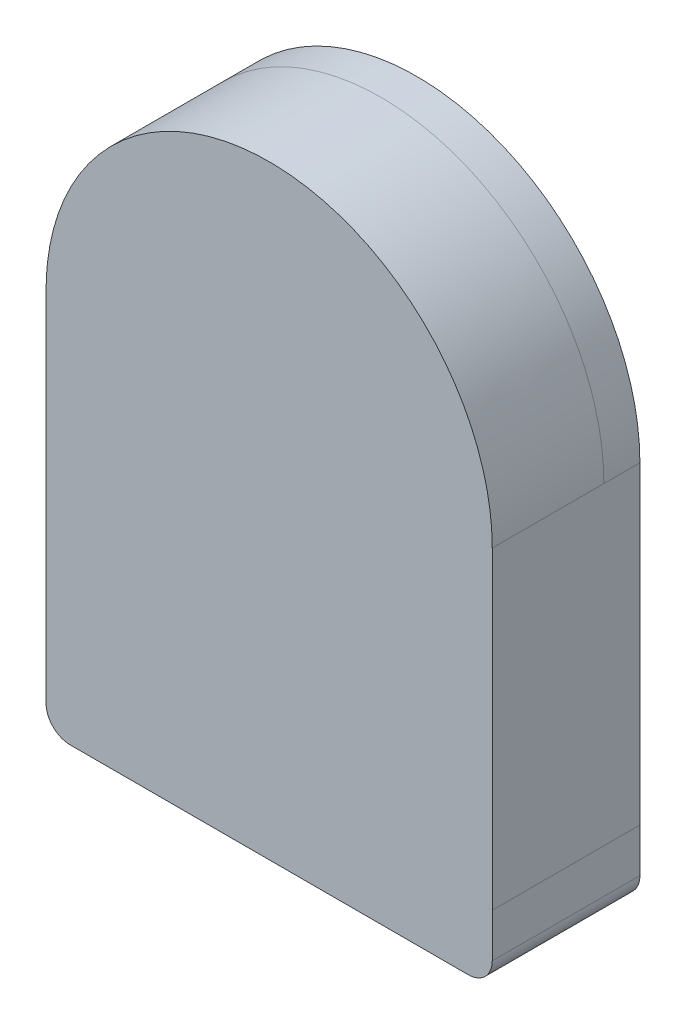
ISO-10303-21;
HEADER;
FILE_DESCRIPTION(('STEP AP214'),'2;1');
FILE_NAME('part.step','',(''),(''),'','','');
FILE_SCHEMA(('AUTOMOTIVE_DESIGN { 1 0 10303 214 1 1 1 1 }'));
ENDSEC;
DATA;
#1=APPLICATION_CONTEXT('core data for automotive mechanical design processes');
#2=APPLICATION_PROTOCOL_DEFINITION('international standard','automotive_design',2000,#1);
#3=PRODUCT_CONTEXT('',#1,'mechanical');
#4=PRODUCT('Part','Part','',(#3));
#5=PRODUCT_RELATED_PRODUCT_CATEGORY('part','',(#4));
#6=PRODUCT_DEFINITION_FORMATION('','',#4);
#7=PRODUCT_DEFINITION_CONTEXT('part definition',#1,'design');
#8=PRODUCT_DEFINITION('design','',#6,#7);
#9=PRODUCT_DEFINITION_SHAPE('','',#8);
#10=(LENGTH_UNIT() NAMED_UNIT(*) SI_UNIT(.MILLI.,.METRE.));
#11=(NAMED_UNIT(*) PLANE_ANGLE_UNIT() SI_UNIT($,.RADIAN.));
#12=(NAMED_UNIT(*) SI_UNIT($,.STERADIAN.) SOLID_ANGLE_UNIT());
#13=UNCERTAINTY_MEASURE_WITH_UNIT(LENGTH_MEASURE(1.E-05),#10,'distance_accuracy_value','');
#14=(GEOMETRIC_REPRESENTATION_CONTEXT(3) GLOBAL_UNCERTAINTY_ASSIGNED_CONTEXT((#13)) GLOBAL_UNIT_ASSIGNED_CONTEXT((#10,
#11,#12)) REPRESENTATION_CONTEXT('',''));
#15=CARTESIAN_POINT('',(0.,0.,0.));
#16=DIRECTION('',(0.,0.,1.));
#17=DIRECTION('',(1.,0.,0.));
#18=AXIS2_PLACEMENT_3D('',#15,#16,#17);
#19=CARTESIAN_POINT('',(8.29127246754,-14.8912724675,3.075));
#20=DIRECTION('',(0.,0.,-1.));
#21=DIRECTION('',(1.,0.,0.));
#22=AXIS2_PLACEMENT_3D('',#19,#20,#21);
#23=CYLINDRICAL_SURFACE('',#22,1.);
#24=CARTESIAN_POINT('',(8.29127246754,-14.8912724675,0.));
#25=DIRECTION('',(0.,0.,1.));
#26=DIRECTION('',(1.,0.,0.));
#27=AXIS2_PLACEMENT_3D('',#24,#25,#26);
#28=CIRCLE('',#27,1.);
#29=CARTESIAN_POINT('',(8.29127246754,-15.8912724675,0.));
#30=VERTEX_POINT('',#29);
#31=CARTESIAN_POINT('',(9.29127246754,-14.8912724675,0.));
#32=VERTEX_POINT('',#31);
#33=EDGE_CURVE('E11',#30,#32,#28,.T.);
#34=ORIENTED_EDGE('',*,*,#33,.T.);
#35=DIRECTION('',(0.,0.,-1.));
#36=VECTOR('',#35,1.);
#37=CARTESIAN_POINT('',(9.29127246754,-14.8912724675,3.075));
#38=LINE('',#37,#36);
#39=CARTESIAN_POINT('',(9.29127246754,-14.8912724675,6.15));
#40=VERTEX_POINT('',#39);
#41=EDGE_CURVE('E207',#40,#32,#38,.T.);
#42=ORIENTED_EDGE('',*,*,#41,.F.);
#43=CARTESIAN_POINT('',(8.29127246754,-14.8912724675,6.15));
#44=DIRECTION('',(0.,0.,-1.));
#45=DIRECTION('',(1.,0.,0.));
#46=AXIS2_PLACEMENT_3D('',#43,#44,#45);
#47=CIRCLE('',#46,1.);
#48=CARTESIAN_POINT('',(8.29127246754,-15.8912724675,6.15));
#49=VERTEX_POINT('',#48);
#50=EDGE_CURVE('E26',#40,#49,#47,.T.);
#51=ORIENTED_EDGE('',*,*,#50,.T.);
#52=DIRECTION('',(0.,0.,-1.));
#53=VECTOR('',#52,1.);
#54=CARTESIAN_POINT('',(8.29127246754,-15.8912724675,3.075));
#55=LINE('',#54,#53);
#56=EDGE_CURVE('E214',#49,#30,#55,.T.);
#57=ORIENTED_EDGE('',*,*,#56,.T.);
#58=EDGE_LOOP('',(#34,#42,#51,#57));
#59=FACE_BOUND('',#58,.T.);
#60=ADVANCED_FACE('F16',(#59),#23,.T.);
#61=CARTESIAN_POINT('',(0.,-3.3,0.));
#62=DIRECTION('',(0.,0.,1.));
#63=DIRECTION('',(1.,0.,0.));
#64=AXIS2_PLACEMENT_3D('',#61,#62,#63);
#65=PLANE('',#64);
#66=ORIENTED_EDGE('',*,*,#33,.F.);
#67=DIRECTION('',(1.,0.,0.));
#68=VECTOR('',#67,1.);
#69=CARTESIAN_POINT('',(6.67750706079,-15.8912724675,0.));
#70=LINE('',#69,#68);
#71=CARTESIAN_POINT('',(5.06374165404,-15.8912724675,0.));
#72=VERTEX_POINT('',#71);
#73=EDGE_CURVE('E203',#72,#30,#70,.T.);
#74=ORIENTED_EDGE('',*,*,#73,.F.);
#75=DIRECTION('',(1.,0.,0.));
#76=VECTOR('',#75,1.);
#77=CARTESIAN_POINT('',(0.00328049456473,-15.8912724675,0.));
#78=LINE('',#77,#76);
#79=CARTESIAN_POINT('',(-5.05718066429,-15.8912724675,0.));
#80=VERTEX_POINT('',#79);
#81=EDGE_CURVE('E161',#80,#72,#78,.T.);
#82=ORIENTED_EDGE('',*,*,#81,.F.);
#83=DIRECTION('',(1.,0.,0.));
#84=VECTOR('',#83,1.);
#85=CARTESIAN_POINT('',(-6.67422656592,-15.8912724675,0.));
#86=LINE('',#85,#84);
#87=CARTESIAN_POINT('',(-8.29127246754,-15.8912724675,0.));
#88=VERTEX_POINT('',#87);
#89=EDGE_CURVE('E156',#88,#80,#86,.T.);
#90=ORIENTED_EDGE('',*,*,#89,.F.);
#91=CARTESIAN_POINT('',(-8.29127246754,-14.8912724675,0.));
#92=DIRECTION('',(0.,0.,1.));
#93=DIRECTION('',(1.,0.,0.));
#94=AXIS2_PLACEMENT_3D('',#91,#92,#93);
#95=CIRCLE('',#94,1.);
#96=CARTESIAN_POINT('',(-9.29127246754,-14.8912724675,0.));
#97=VERTEX_POINT('',#96);
#98=EDGE_CURVE('E266',#97,#88,#95,.T.);
#99=ORIENTED_EDGE('',*,*,#98,.F.);
#100=DIRECTION('',(0.,-1.,0.));
#101=VECTOR('',#100,1.);
#102=CARTESIAN_POINT('',(-9.29127246754,-13.9425119181,0.));
#103=LINE('',#102,#101);
#104=CARTESIAN_POINT('',(-9.29127246754,-12.9937513688,0.));
#105=VERTEX_POINT('',#104);
#106=EDGE_CURVE('E74',#105,#97,#103,.T.);
#107=ORIENTED_EDGE('',*,*,#106,.F.);
#108=DIRECTION('',(0.,1.,0.));
#109=VECTOR('',#108,1.);
#110=CARTESIAN_POINT('',(-9.29127246754,-6.49687568471,0.));
#111=LINE('',#110,#109);
#112=CARTESIAN_POINT('',(-9.29127246754,0.,0.));
#113=VERTEX_POINT('',#112);
#114=EDGE_CURVE('E183',#105,#113,#111,.T.);
#115=ORIENTED_EDGE('',*,*,#114,.T.);
#116=CARTESIAN_POINT('',(0.,0.,0.));
#117=DIRECTION('',(0.,0.,1.));
#118=DIRECTION('',(1.,0.,0.));
#119=AXIS2_PLACEMENT_3D('',#116,#117,#118);
#120=CIRCLE('',#119,9.29127246754);
#121=CARTESIAN_POINT('',(9.29127246754,0.,0.));
#122=VERTEX_POINT('',#121);
#123=EDGE_CURVE('E179',#122,#113,#120,.T.);
#124=ORIENTED_EDGE('',*,*,#123,.F.);
#125=DIRECTION('',(0.,-1.,0.));
#126=VECTOR('',#125,1.);
#127=CARTESIAN_POINT('',(9.29127246754,-6.53289347638,0.));
#128=LINE('',#127,#126);
#129=CARTESIAN_POINT('',(9.29127246754,-13.0657869532,0.));
#130=VERTEX_POINT('',#129);
#131=EDGE_CURVE('E188',#122,#130,#128,.T.);
#132=ORIENTED_EDGE('',*,*,#131,.T.);
#133=DIRECTION('',(0.,1.,0.));
#134=VECTOR('',#133,1.);
#135=CARTESIAN_POINT('',(9.29127246754,-13.9785297104,0.));
#136=LINE('',#135,#134);
#137=EDGE_CURVE('E123',#32,#130,#136,.T.);
#138=ORIENTED_EDGE('',*,*,#137,.F.);
#139=EDGE_LOOP('',(#66,#74,#82,#90,#99,#107,#115,#124,#132,#138));
#140=FACE_BOUND('',#139,.T.);
#141=ADVANCED_FACE('F306',(#140),#65,.F.);
#142=CARTESIAN_POINT('',(0.,0.,6.15));
#143=DIRECTION('',(0.,0.,1.));
#144=DIRECTION('',(1.,0.,0.));
#145=AXIS2_PLACEMENT_3D('',#142,#143,#144);
#146=PLANE('',#145);
#147=DIRECTION('',(0.,1.,0.));
#148=VECTOR('',#147,1.);
#149=CARTESIAN_POINT('',(9.29127246754,-13.9785297104,6.15));
#150=LINE('',#149,#148);
#151=CARTESIAN_POINT('',(9.29127246754,-13.0657869532,6.15));
#152=VERTEX_POINT('',#151);
#153=EDGE_CURVE('E213',#40,#152,#150,.T.);
#154=ORIENTED_EDGE('',*,*,#153,.T.);
#155=DIRECTION('',(0.,1.,0.));
#156=VECTOR('',#155,1.);
#157=CARTESIAN_POINT('',(9.29127246754,-6.53289347666,6.15));
#158=LINE('',#157,#156);
#159=CARTESIAN_POINT('',(9.29127246754,-1.08640207941E-10,6.15));
#160=VERTEX_POINT('',#159);
#161=EDGE_CURVE('E192',#152,#160,#158,.T.);
#162=ORIENTED_EDGE('',*,*,#161,.T.);
#163=CARTESIAN_POINT('',(9.29127246754,-1.0863723428E-10,6.15));
#164=CARTESIAN_POINT('',(9.29127246754,1.45946966633,6.15));
#165=CARTESIAN_POINT('',(9.00470626867,2.91893933265,6.15));
#166=CARTESIAN_POINT('',(8.43129066116,4.30328706918,6.15));
#167=CARTESIAN_POINT('',(6.77255467012,6.77255467012,6.15));
#168=CARTESIAN_POINT('',(4.30328706918,8.43129066116,6.15));
#169=CARTESIAN_POINT('',(2.91893933265,9.00470626867,6.15));
#170=CARTESIAN_POINT('',(0.,9.5778386664,6.15));
#171=CARTESIAN_POINT('',(-2.91893933265,9.00470626867,6.15));
#172=CARTESIAN_POINT('',(-4.30328706918,8.43129066116,6.15));
#173=CARTESIAN_POINT('',(-6.77255467012,6.77255467012,6.15));
#174=CARTESIAN_POINT('',(-8.43129066116,4.30328706918,6.15));
#175=CARTESIAN_POINT('',(-9.00470626867,2.91893933265,6.15));
#176=CARTESIAN_POINT('',(-9.29127246754,1.45946966633,6.15));
#177=CARTESIAN_POINT('',(-9.29127246754,0.,6.15));
#178=(BOUNDED_CURVE() B_SPLINE_CURVE(5,(#163,#164,#165,#166,#167,#168,#169,#170,#171,#172,#173,
#174,#175,#176,#177),.UNSPECIFIED.,.F.,.F.) B_SPLINE_CURVE_WITH_KNOTS((6,3,3,3,6),
(-47.0355013243,-39.7381529927,-32.4408046611,-25.1434563295,-17.8461079978),
.UNSPECIFIED.) CURVE() GEOMETRIC_REPRESENTATION_ITEM() RATIONAL_B_SPLINE_CURVE((1.,1.,1.,1.,1.,
1.,1.,1.,1.,1.,1.,1.,1.,1.,1.)) REPRESENTATION_ITEM(''));
#179=CARTESIAN_POINT('',(-9.29127246754,0.,6.15));
#180=VERTEX_POINT('',#179);
#181=EDGE_CURVE('E182',#160,#180,#178,.T.);
#182=ORIENTED_EDGE('',*,*,#181,.T.);
#183=DIRECTION('',(0.,-1.,0.));
#184=VECTOR('',#183,1.);
#185=CARTESIAN_POINT('',(-9.29127246754,-6.49687568438,6.15));
#186=LINE('',#185,#184);
#187=CARTESIAN_POINT('',(-9.29127246754,-12.9937513688,6.15));
#188=VERTEX_POINT('',#187);
#189=EDGE_CURVE('E208',#180,#188,#186,.T.);
#190=ORIENTED_EDGE('',*,*,#189,.T.);
#191=DIRECTION('',(0.,-1.,0.));
#192=VECTOR('',#191,1.);
#193=CARTESIAN_POINT('',(-9.29127246754,-13.9425119181,6.15));
#194=LINE('',#193,#192);
#195=CARTESIAN_POINT('',(-9.29127246754,-14.8912724675,6.15));
#196=VERTEX_POINT('',#195);
#197=EDGE_CURVE('E59',#188,#196,#194,.T.);
#198=ORIENTED_EDGE('',*,*,#197,.T.);
#199=CARTESIAN_POINT('',(-8.29127246754,-14.8912724675,6.15));
#200=DIRECTION('',(0.,0.,-1.));
#201=DIRECTION('',(1.,0.,0.));
#202=AXIS2_PLACEMENT_3D('',#199,#200,#201);
#203=CIRCLE('',#202,1.);
#204=CARTESIAN_POINT('',(-8.29127246754,-15.8912724675,6.15));
#205=VERTEX_POINT('',#204);
#206=EDGE_CURVE('E204',#205,#196,#203,.T.);
#207=ORIENTED_EDGE('',*,*,#206,.F.);
#208=DIRECTION('',(1.,0.,0.));
#209=VECTOR('',#208,1.);
#210=CARTESIAN_POINT('',(-6.67422656592,-15.8912724675,6.15));
#211=LINE('',#210,#209);
#212=CARTESIAN_POINT('',(-5.05718066429,-15.8912724675,6.15));
#213=VERTEX_POINT('',#212);
#214=EDGE_CURVE('E197',#205,#213,#211,.T.);
#215=ORIENTED_EDGE('',*,*,#214,.T.);
#216=DIRECTION('',(1.,0.,0.));
#217=VECTOR('',#216,1.);
#218=CARTESIAN_POINT('',(0.00328049487454,-15.8912724675,6.15));
#219=LINE('',#218,#217);
#220=CARTESIAN_POINT('',(5.06374165404,-15.8912724675,6.15));
#221=VERTEX_POINT('',#220);
#222=EDGE_CURVE('E166',#213,#221,#219,.T.);
#223=ORIENTED_EDGE('',*,*,#222,.T.);
#224=DIRECTION('',(1.,0.,0.));
#225=VECTOR('',#224,1.);
#226=CARTESIAN_POINT('',(6.67750706079,-15.8912724675,6.15));
#227=LINE('',#226,#225);
#228=EDGE_CURVE('E134',#221,#49,#227,.T.);
#229=ORIENTED_EDGE('',*,*,#228,.T.);
#230=ORIENTED_EDGE('',*,*,#50,.F.);
#231=EDGE_LOOP('',(#154,#162,#182,#190,#198,#207,#215,#223,#229,#230));
#232=FACE_BOUND('',#231,.T.);
#233=ADVANCED_FACE('F314',(#232),#146,.T.);
#234=CARTESIAN_POINT('',(9.29127246754,-13.0657869525,0.));
#235=DIRECTION('',(1.,0.,0.));
#236=DIRECTION('',(0.,-1.,0.));
#237=AXIS2_PLACEMENT_3D('',#234,#235,#236);
#238=PLANE('',#237);
#239=ORIENTED_EDGE('',*,*,#137,.T.);
#240=DIRECTION('',(0.,0.,-1.));
#241=VECTOR('',#240,1.);
#242=CARTESIAN_POINT('',(9.29127246754,-13.0657869525,3.075));
#243=LINE('',#242,#241);
#244=EDGE_CURVE('E187',#152,#130,#243,.T.);
#245=ORIENTED_EDGE('',*,*,#244,.F.);
#246=ORIENTED_EDGE('',*,*,#153,.F.);
#247=ORIENTED_EDGE('',*,*,#41,.T.);
#248=EDGE_LOOP('',(#239,#245,#246,#247));
#249=FACE_BOUND('',#248,.T.);
#250=ADVANCED_FACE('F250',(#249),#238,.T.);
#251=CARTESIAN_POINT('',(-5.0571806643,-15.8912724675,0.));
#252=DIRECTION('',(0.,-1.,0.));
#253=DIRECTION('',(0.,0.,-1.));
#254=AXIS2_PLACEMENT_3D('',#251,#252,#253);
#255=PLANE('',#254);
#256=ORIENTED_EDGE('',*,*,#228,.F.);
#257=DIRECTION('',(0.,0.,-1.));
#258=VECTOR('',#257,1.);
#259=CARTESIAN_POINT('',(5.06374165404,-15.8912724675,3.825));
#260=LINE('',#259,#258);
#261=CARTESIAN_POINT('',(5.06374165404,-15.8912724675,1.5));
#262=VERTEX_POINT('',#261);
#263=EDGE_CURVE('E225',#221,#262,#260,.T.);
#264=ORIENTED_EDGE('',*,*,#263,.T.);
#265=DIRECTION('',(0.,0.,-1.));
#266=VECTOR('',#265,1.);
#267=CARTESIAN_POINT('',(5.06374165343,-15.8912724675,0.75));
#268=LINE('',#267,#266);
#269=EDGE_CURVE('E221',#262,#72,#268,.T.);
#270=ORIENTED_EDGE('',*,*,#269,.T.);
#271=ORIENTED_EDGE('',*,*,#73,.T.);
#272=ORIENTED_EDGE('',*,*,#56,.F.);
#273=EDGE_LOOP('',(#256,#264,#270,#271,#272));
#274=FACE_BOUND('',#273,.T.);
#275=ADVANCED_FACE('F340',(#274),#255,.T.);
#276=CARTESIAN_POINT('',(-8.29127246754,-14.8912724675,3.075));
#277=DIRECTION('',(0.,0.,-1.));
#278=DIRECTION('',(0.,-1.,0.));
#279=AXIS2_PLACEMENT_3D('',#276,#277,#278);
#280=CYLINDRICAL_SURFACE('',#279,1.);
#281=ORIENTED_EDGE('',*,*,#98,.T.);
#282=DIRECTION('',(0.,0.,-1.));
#283=VECTOR('',#282,1.);
#284=CARTESIAN_POINT('',(-8.29127246754,-15.8912724675,3.075));
#285=LINE('',#284,#283);
#286=EDGE_CURVE('E199',#205,#88,#285,.T.);
#287=ORIENTED_EDGE('',*,*,#286,.F.);
#288=ORIENTED_EDGE('',*,*,#206,.T.);
#289=DIRECTION('',(0.,0.,-1.));
#290=VECTOR('',#289,1.);
#291=CARTESIAN_POINT('',(-9.29127246754,-14.8912724675,3.075));
#292=LINE('',#291,#290);
#293=EDGE_CURVE('E193',#196,#97,#292,.T.);
#294=ORIENTED_EDGE('',*,*,#293,.T.);
#295=EDGE_LOOP('',(#281,#287,#288,#294));
#296=FACE_BOUND('',#295,.T.);
#297=ADVANCED_FACE('F348',(#296),#280,.T.);
#298=CARTESIAN_POINT('',(-5.0571806643,-15.8912724675,0.));
#299=DIRECTION('',(0.,-1.,0.));
#300=DIRECTION('',(0.,0.,-1.));
#301=AXIS2_PLACEMENT_3D('',#298,#299,#300);
#302=PLANE('',#301);
#303=ORIENTED_EDGE('',*,*,#89,.T.);
#304=DIRECTION('',(0.,0.,-1.));
#305=VECTOR('',#304,1.);
#306=CARTESIAN_POINT('',(-5.0571806643,-15.8912724675,0.75));
#307=LINE('',#306,#305);
#308=CARTESIAN_POINT('',(-5.0571806643,-15.8912724675,1.5));
#309=VERTEX_POINT('',#308);
#310=EDGE_CURVE('E149',#309,#80,#307,.T.);
#311=ORIENTED_EDGE('',*,*,#310,.F.);
#312=DIRECTION('',(0.,0.,-1.));
#313=VECTOR('',#312,1.);
#314=CARTESIAN_POINT('',(-5.05718066429,-15.8912724675,3.825));
#315=LINE('',#314,#313);
#316=EDGE_CURVE('E153',#213,#309,#315,.T.);
#317=ORIENTED_EDGE('',*,*,#316,.F.);
#318=ORIENTED_EDGE('',*,*,#214,.F.);
#319=ORIENTED_EDGE('',*,*,#286,.T.);
#320=EDGE_LOOP('',(#303,#311,#317,#318,#319));
#321=FACE_BOUND('',#320,.T.);
#322=ADVANCED_FACE('F151',(#321),#302,.T.);
#323=CARTESIAN_POINT('',(-9.29127246754,0.,0.));
#324=DIRECTION('',(-1.,0.,0.));
#325=DIRECTION('',(0.,1.,0.));
#326=AXIS2_PLACEMENT_3D('',#323,#324,#325);
#327=PLANE('',#326);
#328=ORIENTED_EDGE('',*,*,#197,.F.);
#329=DIRECTION('',(0.,0.,-1.));
#330=VECTOR('',#329,1.);
#331=CARTESIAN_POINT('',(-9.29127246754,-12.9937513688,3.075));
#332=LINE('',#331,#330);
#333=EDGE_CURVE('E186',#188,#105,#332,.T.);
#334=ORIENTED_EDGE('',*,*,#333,.T.);
#335=ORIENTED_EDGE('',*,*,#106,.T.);
#336=ORIENTED_EDGE('',*,*,#293,.F.);
#337=EDGE_LOOP('',(#328,#334,#335,#336));
#338=FACE_BOUND('',#337,.T.);
#339=ADVANCED_FACE('F299',(#338),#327,.T.);
#340=CARTESIAN_POINT('',(-9.29127246754,0.,0.));
#341=DIRECTION('',(-1.,0.,0.));
#342=DIRECTION('',(0.,1.,0.));
#343=AXIS2_PLACEMENT_3D('',#340,#341,#342);
#344=PLANE('',#343);
#345=ORIENTED_EDGE('',*,*,#114,.F.);
#346=ORIENTED_EDGE('',*,*,#333,.F.);
#347=ORIENTED_EDGE('',*,*,#189,.F.);
#348=DIRECTION('',(0.,0.,1.));
#349=VECTOR('',#348,1.);
#350=CARTESIAN_POINT('',(-9.29127246754,0.,3.825));
#351=LINE('',#350,#349);
#352=CARTESIAN_POINT('',(-9.29127246754,0.,1.5));
#353=VERTEX_POINT('',#352);
#354=EDGE_CURVE('E288',#353,#180,#351,.T.);
#355=ORIENTED_EDGE('',*,*,#354,.F.);
#356=DIRECTION('',(0.,0.,1.));
#357=VECTOR('',#356,1.);
#358=CARTESIAN_POINT('',(-9.29127246754,0.,0.));
#359=LINE('',#358,#357);
#360=EDGE_CURVE('E174',#113,#353,#359,.T.);
#361=ORIENTED_EDGE('',*,*,#360,.F.);
#362=EDGE_LOOP('',(#345,#346,#347,#355,#361));
#363=FACE_BOUND('',#362,.T.);
#364=ADVANCED_FACE('F303',(#363),#344,.T.);
#365=CARTESIAN_POINT('',(9.29127246754,-13.0657869525,0.));
#366=DIRECTION('',(1.,0.,0.));
#367=DIRECTION('',(0.,-1.,0.));
#368=AXIS2_PLACEMENT_3D('',#365,#366,#367);
#369=PLANE('',#368);
#370=ORIENTED_EDGE('',*,*,#131,.F.);
#371=DIRECTION('',(0.,0.,1.));
#372=VECTOR('',#371,1.);
#373=CARTESIAN_POINT('',(9.29127246754,0.,0.));
#374=LINE('',#373,#372);
#375=CARTESIAN_POINT('',(9.29127246754,-1.08640207941E-10,1.5));
#376=VERTEX_POINT('',#375);
#377=EDGE_CURVE('E168',#122,#376,#374,.T.);
#378=ORIENTED_EDGE('',*,*,#377,.T.);
#379=DIRECTION('',(0.,0.,1.));
#380=VECTOR('',#379,1.);
#381=CARTESIAN_POINT('',(9.29127246754,-1.08633546603E-10,3.825));
#382=LINE('',#381,#380);
#383=EDGE_CURVE('E312',#376,#160,#382,.T.);
#384=ORIENTED_EDGE('',*,*,#383,.T.);
#385=ORIENTED_EDGE('',*,*,#161,.F.);
#386=ORIENTED_EDGE('',*,*,#244,.T.);
#387=EDGE_LOOP('',(#370,#378,#384,#385,#386));
#388=FACE_BOUND('',#387,.T.);
#389=ADVANCED_FACE('F252',(#388),#369,.T.);
#390=CARTESIAN_POINT('',(-5.0571806643,-15.8912724675,0.));
#391=DIRECTION('',(0.,-1.,0.));
#392=DIRECTION('',(0.,0.,-1.));
#393=AXIS2_PLACEMENT_3D('',#390,#391,#392);
#394=PLANE('',#393);
#395=ORIENTED_EDGE('',*,*,#316,.T.);
#396=ORIENTED_EDGE('',*,*,#310,.T.);
#397=ORIENTED_EDGE('',*,*,#81,.T.);
#398=ORIENTED_EDGE('',*,*,#269,.F.);
#399=ORIENTED_EDGE('',*,*,#263,.F.);
#400=ORIENTED_EDGE('',*,*,#222,.F.);
#401=EDGE_LOOP('',(#395,#396,#397,#398,#399,#400));
#402=FACE_BOUND('',#401,.T.);
#403=ADVANCED_FACE('F164',(#402),#394,.T.);
#404=CARTESIAN_POINT('',(0.,0.,0.));
#405=DIRECTION('',(0.,0.,1.));
#406=DIRECTION('',(1.,0.,0.));
#407=AXIS2_PLACEMENT_3D('',#404,#405,#406);
#408=CYLINDRICAL_SURFACE('',#407,9.29127246754);
#409=ORIENTED_EDGE('',*,*,#123,.T.);
#410=ORIENTED_EDGE('',*,*,#360,.T.);
#411=CARTESIAN_POINT('',(9.29127246754,-1.0863723428E-10,1.5));
#412=CARTESIAN_POINT('',(9.29127246754,1.45946966633,1.5));
#413=CARTESIAN_POINT('',(9.00470626867,2.91893933265,1.5));
#414=CARTESIAN_POINT('',(8.43129066116,4.30328706918,1.5));
#415=CARTESIAN_POINT('',(6.77255467012,6.77255467012,1.5));
#416=CARTESIAN_POINT('',(4.30328706918,8.43129066116,1.5));
#417=CARTESIAN_POINT('',(2.91893933265,9.00470626867,1.5));
#418=CARTESIAN_POINT('',(0.,9.5778386664,1.5));
#419=CARTESIAN_POINT('',(-2.91893933265,9.00470626867,1.5));
#420=CARTESIAN_POINT('',(-4.30328706918,8.43129066116,1.5));
#421=CARTESIAN_POINT('',(-6.77255467012,6.77255467012,1.5));
#422=CARTESIAN_POINT('',(-8.43129066116,4.30328706918,1.5));
#423=CARTESIAN_POINT('',(-9.00470626867,2.91893933265,1.5));
#424=CARTESIAN_POINT('',(-9.29127246754,1.45946966633,1.5));
#425=CARTESIAN_POINT('',(-9.29127246754,0.,1.5));
#426=(BOUNDED_CURVE() B_SPLINE_CURVE(5,(#411,#412,#413,#414,#415,#416,#417,#418,#419,#420,#421,
#422,#423,#424,#425),.UNSPECIFIED.,.F.,.F.) B_SPLINE_CURVE_WITH_KNOTS((6,3,3,3,6),(0.,
7.433822163,14.8676443261,22.30146648915,29.7352886522),
.UNSPECIFIED.) CURVE() GEOMETRIC_REPRESENTATION_ITEM() RATIONAL_B_SPLINE_CURVE((1.,1.,1.,1.,1.,
1.,1.,1.,1.,1.,1.,1.,1.,1.,1.)) REPRESENTATION_ITEM(''));
#427=EDGE_CURVE('E232',#376,#353,#426,.T.);
#428=ORIENTED_EDGE('',*,*,#427,.F.);
#429=ORIENTED_EDGE('',*,*,#377,.F.);
#430=EDGE_LOOP('',(#409,#410,#428,#429));
#431=FACE_BOUND('',#430,.T.);
#432=ADVANCED_FACE('F249',(#431),#408,.T.);
#433=CARTESIAN_POINT('',(-9.29127246754,0.,1.5));
#434=CARTESIAN_POINT('',(-9.29127246754,1.45946966633,1.5));
#435=CARTESIAN_POINT('',(-9.00470626867,2.91893933265,1.5));
#436=CARTESIAN_POINT('',(-8.43129066116,4.30328706918,1.5));
#437=CARTESIAN_POINT('',(-6.77255467012,6.77255467012,1.5));
#438=CARTESIAN_POINT('',(-4.30328706918,8.43129066116,1.5));
#439=CARTESIAN_POINT('',(-2.91893933265,9.00470626867,1.5));
#440=CARTESIAN_POINT('',(0.,9.5778386664,1.5));
#441=CARTESIAN_POINT('',(2.91893933265,9.00470626867,1.5));
#442=CARTESIAN_POINT('',(4.30328706918,8.43129066116,1.5));
#443=CARTESIAN_POINT('',(6.77255467012,6.77255467012,1.5));
#444=CARTESIAN_POINT('',(8.43129066116,4.30328706918,1.5));
#445=CARTESIAN_POINT('',(9.00470626867,2.91893933265,1.5));
#446=CARTESIAN_POINT('',(9.29127246754,1.45946966633,1.5));
#447=CARTESIAN_POINT('',(9.29127246754,-1.0863723428E-10,1.5));
#448=(BOUNDED_CURVE() B_SPLINE_CURVE(5,(#433,#434,#435,#436,#437,#438,#439,#440,#441,#442,#443,
#444,#445,#446,#447),.UNSPECIFIED.,.F.,.F.) B_SPLINE_CURVE_WITH_KNOTS((6,3,3,3,6),(0.,
7.43382216305,14.8676443261,22.3014664892,29.7352886522),
.UNSPECIFIED.) CURVE() GEOMETRIC_REPRESENTATION_ITEM() RATIONAL_B_SPLINE_CURVE((1.,1.,1.,1.,1.,
1.,1.,1.,1.,1.,1.,1.,1.,1.,1.)) REPRESENTATION_ITEM(''));
#449=DIRECTION('',(0.,0.,1.));
#450=VECTOR('',#449,1.);
#451=SURFACE_OF_LINEAR_EXTRUSION('',#448,#450);
#452=ORIENTED_EDGE('',*,*,#383,.F.);
#453=ORIENTED_EDGE('',*,*,#427,.T.);
#454=ORIENTED_EDGE('',*,*,#354,.T.);
#455=ORIENTED_EDGE('',*,*,#181,.F.);
#456=EDGE_LOOP('',(#452,#453,#454,#455));
#457=FACE_BOUND('',#456,.T.);
#458=ADVANCED_FACE('F238',(#457),#451,.F.);
#459=CLOSED_SHELL('',(#60,#141,#233,#250,#275,#297,#322,#339,#364,#389,#403,#432,#458));
#460=MANIFOLD_SOLID_BREP('B1',#459);
#461=ADVANCED_BREP_SHAPE_REPRESENTATION('',(#18,#460),#14);
#462=SHAPE_DEFINITION_REPRESENTATION(#9,#461);
ENDSEC;
END-ISO-10303-21;
